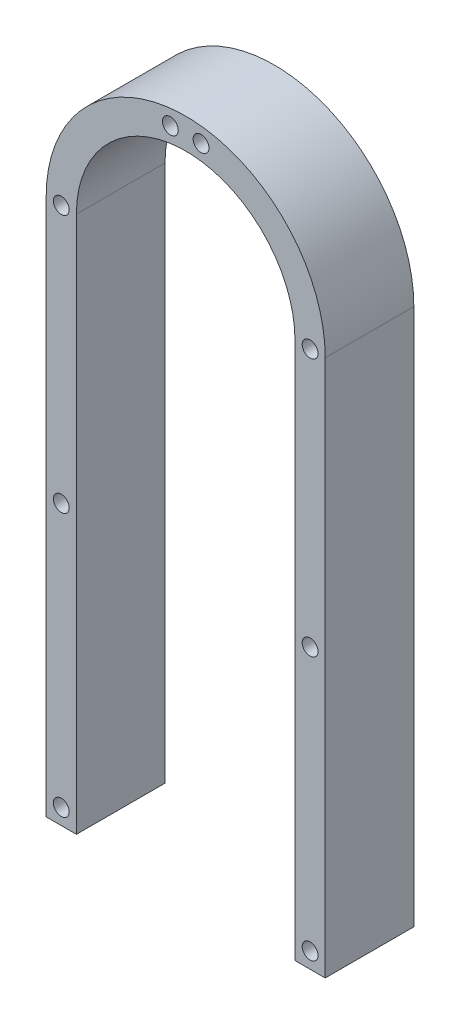
ISO-10303-21;
HEADER;
FILE_DESCRIPTION(('STEP AP214'),'2;1');
FILE_NAME('part.step','',(''),(''),'','','');
FILE_SCHEMA(('AUTOMOTIVE_DESIGN { 1 0 10303 214 1 1 1 1 }'));
ENDSEC;
DATA;
#1=APPLICATION_CONTEXT('core data for automotive mechanical design processes');
#2=APPLICATION_PROTOCOL_DEFINITION('international standard','automotive_design',2000,#1);
#3=PRODUCT_CONTEXT('',#1,'mechanical');
#4=PRODUCT('Part','Part','',(#3));
#5=PRODUCT_RELATED_PRODUCT_CATEGORY('part','',(#4));
#6=PRODUCT_DEFINITION_FORMATION('','',#4);
#7=PRODUCT_DEFINITION_CONTEXT('part definition',#1,'design');
#8=PRODUCT_DEFINITION('design','',#6,#7);
#9=PRODUCT_DEFINITION_SHAPE('','',#8);
#10=(LENGTH_UNIT() NAMED_UNIT(*) SI_UNIT(.MILLI.,.METRE.));
#11=(NAMED_UNIT(*) PLANE_ANGLE_UNIT() SI_UNIT($,.RADIAN.));
#12=(NAMED_UNIT(*) SI_UNIT($,.STERADIAN.) SOLID_ANGLE_UNIT());
#13=UNCERTAINTY_MEASURE_WITH_UNIT(LENGTH_MEASURE(1.E-05),#10,'distance_accuracy_value','');
#14=(GEOMETRIC_REPRESENTATION_CONTEXT(3) GLOBAL_UNCERTAINTY_ASSIGNED_CONTEXT((#13)) GLOBAL_UNIT_ASSIGNED_CONTEXT((#10,
#11,#12)) REPRESENTATION_CONTEXT('',''));
#15=CARTESIAN_POINT('',(0.,0.,0.));
#16=DIRECTION('',(0.,0.,1.));
#17=DIRECTION('',(1.,0.,0.));
#18=AXIS2_PLACEMENT_3D('',#15,#16,#17);
#19=CARTESIAN_POINT('',(-149.085368150531,-18.7891941834329,19.05));
#20=DIRECTION('',(0.,0.,1.));
#21=DIRECTION('',(1.,0.,0.));
#22=AXIS2_PLACEMENT_3D('',#19,#20,#21);
#23=PLANE('',#22);
#24=DIRECTION('',(-1.,0.,0.));
#25=VECTOR('',#24,1.);
#26=CARTESIAN_POINT('',(-149.085368150531,96.6995702810626,19.05));
#27=LINE('',#26,#25);
#28=CARTESIAN_POINT('',(-119.085368150531,96.6995702810626,19.05));
#29=VERTEX_POINT('',#28);
#30=CARTESIAN_POINT('',(-125.585368150531,96.6995702810626,19.05));
#31=VERTEX_POINT('',#30);
#32=EDGE_CURVE('E49',#29,#31,#27,.T.);
#33=ORIENTED_EDGE('',*,*,#32,.F.);
#34=DIRECTION('',(0.,1.,0.));
#35=VECTOR('',#34,1.);
#36=CARTESIAN_POINT('',(-119.085368150531,-18.7891941834329,19.05));
#37=LINE('',#36,#35);
#38=CARTESIAN_POINT('',(-119.085368150531,212.188334745558,19.05));
#39=VERTEX_POINT('',#38);
#40=EDGE_CURVE('E109',#29,#39,#37,.T.);
#41=ORIENTED_EDGE('',*,*,#40,.T.);
#42=CARTESIAN_POINT('',(-149.085368150531,212.188334745558,19.05));
#43=DIRECTION('',(0.,0.,1.));
#44=DIRECTION('',(1.,0.,0.));
#45=AXIS2_PLACEMENT_3D('',#42,#43,#44);
#46=CIRCLE('',#45,30.);
#47=CARTESIAN_POINT('',(-179.085368150531,212.188334745558,19.05));
#48=VERTEX_POINT('',#47);
#49=EDGE_CURVE('E117',#39,#48,#46,.T.);
#50=ORIENTED_EDGE('',*,*,#49,.T.);
#51=DIRECTION('',(0.,-1.,0.));
#52=VECTOR('',#51,1.);
#53=CARTESIAN_POINT('',(-179.085368150531,-18.7891941834329,19.05));
#54=LINE('',#53,#52);
#55=CARTESIAN_POINT('',(-179.085368150531,96.6995702810626,19.05));
#56=VERTEX_POINT('',#55);
#57=EDGE_CURVE('E120',#48,#56,#54,.T.);
#58=ORIENTED_EDGE('',*,*,#57,.T.);
#59=CARTESIAN_POINT('',(-172.585368150531,96.6995702810626,19.05));
#60=VERTEX_POINT('',#59);
#61=EDGE_CURVE('E113',#60,#56,#27,.T.);
#62=ORIENTED_EDGE('',*,*,#61,.F.);
#63=DIRECTION('',(0.,-1.,0.));
#64=VECTOR('',#63,1.);
#65=CARTESIAN_POINT('',(-172.585368150531,-18.7891941834329,19.05));
#66=LINE('',#65,#64);
#67=CARTESIAN_POINT('',(-172.585368150531,212.188334745558,19.05));
#68=VERTEX_POINT('',#67);
#69=EDGE_CURVE('E151',#68,#60,#66,.T.);
#70=ORIENTED_EDGE('',*,*,#69,.F.);
#71=CARTESIAN_POINT('',(-149.085368150531,212.188334745558,19.05));
#72=DIRECTION('',(0.,0.,1.));
#73=DIRECTION('',(1.,0.,0.));
#74=AXIS2_PLACEMENT_3D('',#71,#72,#73);
#75=CIRCLE('',#74,23.5);
#76=CARTESIAN_POINT('',(-125.585368150531,212.188334745558,19.05));
#77=VERTEX_POINT('',#76);
#78=EDGE_CURVE('E157',#77,#68,#75,.T.);
#79=ORIENTED_EDGE('',*,*,#78,.F.);
#80=DIRECTION('',(0.,1.,0.));
#81=VECTOR('',#80,1.);
#82=CARTESIAN_POINT('',(-125.585368150531,-18.7891941834329,19.05));
#83=LINE('',#82,#81);
#84=EDGE_CURVE('E112',#31,#77,#83,.T.);
#85=ORIENTED_EDGE('',*,*,#84,.F.);
#86=EDGE_LOOP('',(#33,#41,#50,#58,#62,#70,#79,#85));
#87=FACE_BOUND('',#86,.T.);
#88=CARTESIAN_POINT('',(-122.335368150531,100.099570281063,19.05));
#89=DIRECTION('',(0.,0.,1.));
#90=DIRECTION('',(1.,0.,0.));
#91=AXIS2_PLACEMENT_3D('',#88,#89,#90);
#92=CIRCLE('',#91,1.7);
#93=CARTESIAN_POINT('',(-120.635368150531,100.099570281063,19.05));
#94=VERTEX_POINT('',#93);
#95=EDGE_CURVE('E103',#94,#94,#92,.T.);
#96=ORIENTED_EDGE('',*,*,#95,.F.);
#97=EDGE_LOOP('',(#96));
#98=FACE_BOUND('',#97,.T.);
#99=CARTESIAN_POINT('',(-152.385368150531,238.734002942083,19.05));
#100=DIRECTION('',(0.,0.,1.));
#101=DIRECTION('',(1.,0.,0.));
#102=AXIS2_PLACEMENT_3D('',#99,#100,#101);
#103=CIRCLE('',#102,1.70000000000001);
#104=CARTESIAN_POINT('',(-150.685368150531,238.734002942083,19.05));
#105=VERTEX_POINT('',#104);
#106=EDGE_CURVE('E209',#105,#105,#103,.T.);
#107=ORIENTED_EDGE('',*,*,#106,.F.);
#108=EDGE_LOOP('',(#107));
#109=FACE_BOUND('',#108,.T.);
#110=CARTESIAN_POINT('',(-122.335368150531,156.699570281063,19.05));
#111=DIRECTION('',(0.,0.,1.));
#112=DIRECTION('',(1.,0.,0.));
#113=AXIS2_PLACEMENT_3D('',#110,#111,#112);
#114=CIRCLE('',#113,1.7);
#115=CARTESIAN_POINT('',(-120.635368150531,156.699570281063,19.05));
#116=VERTEX_POINT('',#115);
#117=EDGE_CURVE('E203',#116,#116,#114,.T.);
#118=ORIENTED_EDGE('',*,*,#117,.F.);
#119=EDGE_LOOP('',(#118));
#120=FACE_BOUND('',#119,.T.);
#121=CARTESIAN_POINT('',(-175.835368150531,156.699570281063,19.05));
#122=DIRECTION('',(0.,0.,1.));
#123=DIRECTION('',(1.,0.,0.));
#124=AXIS2_PLACEMENT_3D('',#121,#122,#123);
#125=CIRCLE('',#124,1.70000000000001);
#126=CARTESIAN_POINT('',(-174.135368150531,156.699570281063,19.05));
#127=VERTEX_POINT('',#126);
#128=EDGE_CURVE('E197',#127,#127,#125,.T.);
#129=ORIENTED_EDGE('',*,*,#128,.F.);
#130=EDGE_LOOP('',(#129));
#131=FACE_BOUND('',#130,.T.);
#132=CARTESIAN_POINT('',(-175.835368150531,100.099570281063,19.05));
#133=DIRECTION('',(0.,0.,1.));
#134=DIRECTION('',(1.,0.,0.));
#135=AXIS2_PLACEMENT_3D('',#132,#133,#134);
#136=CIRCLE('',#135,1.70000000000001);
#137=CARTESIAN_POINT('',(-174.135368150531,100.099570281063,19.05));
#138=VERTEX_POINT('',#137);
#139=EDGE_CURVE('E191',#138,#138,#136,.T.);
#140=ORIENTED_EDGE('',*,*,#139,.F.);
#141=EDGE_LOOP('',(#140));
#142=FACE_BOUND('',#141,.T.);
#143=CARTESIAN_POINT('',(-175.835368150529,212.188334745556,19.05));
#144=DIRECTION('',(0.,0.,1.));
#145=DIRECTION('',(1.,0.,0.));
#146=AXIS2_PLACEMENT_3D('',#143,#144,#145);
#147=CIRCLE('',#146,1.70000000000001);
#148=CARTESIAN_POINT('',(-174.135368150529,212.188334745556,19.05));
#149=VERTEX_POINT('',#148);
#150=EDGE_CURVE('E185',#149,#149,#147,.T.);
#151=ORIENTED_EDGE('',*,*,#150,.F.);
#152=EDGE_LOOP('',(#151));
#153=FACE_BOUND('',#152,.T.);
#154=CARTESIAN_POINT('',(-122.335368150529,212.18833474556,19.05));
#155=DIRECTION('',(0.,0.,1.));
#156=DIRECTION('',(1.,0.,0.));
#157=AXIS2_PLACEMENT_3D('',#154,#155,#156);
#158=CIRCLE('',#157,1.7);
#159=CARTESIAN_POINT('',(-120.635368150529,212.18833474556,19.05));
#160=VERTEX_POINT('',#159);
#161=EDGE_CURVE('E179',#160,#160,#158,.T.);
#162=ORIENTED_EDGE('',*,*,#161,.F.);
#163=EDGE_LOOP('',(#162));
#164=FACE_BOUND('',#163,.T.);
#165=CARTESIAN_POINT('',(-145.785368150531,238.734002942083,19.05));
#166=DIRECTION('',(0.,0.,1.));
#167=DIRECTION('',(1.,0.,0.));
#168=AXIS2_PLACEMENT_3D('',#165,#166,#167);
#169=CIRCLE('',#168,1.70000000000001);
#170=CARTESIAN_POINT('',(-144.085368150531,238.734002942083,19.05));
#171=VERTEX_POINT('',#170);
#172=EDGE_CURVE('E173',#171,#171,#169,.T.);
#173=ORIENTED_EDGE('',*,*,#172,.F.);
#174=EDGE_LOOP('',(#173));
#175=FACE_BOUND('',#174,.T.);
#176=ADVANCED_FACE('F34',(#87,#98,#109,#120,#131,#142,#153,#164,#175),#23,.T.);
#177=CARTESIAN_POINT('',(-149.085368150531,-18.7891941834329,0.));
#178=DIRECTION('',(0.,0.,1.));
#179=DIRECTION('',(1.,0.,0.));
#180=AXIS2_PLACEMENT_3D('',#177,#178,#179);
#181=PLANE('',#180);
#182=CARTESIAN_POINT('',(-122.335368150531,100.099570281063,0.));
#183=DIRECTION('',(0.,0.,1.));
#184=DIRECTION('',(1.,0.,0.));
#185=AXIS2_PLACEMENT_3D('',#182,#183,#184);
#186=CIRCLE('',#185,1.7);
#187=CARTESIAN_POINT('',(-120.635368150531,100.099570281063,0.));
#188=VERTEX_POINT('',#187);
#189=EDGE_CURVE('E212',#188,#188,#186,.T.);
#190=ORIENTED_EDGE('',*,*,#189,.T.);
#191=EDGE_LOOP('',(#190));
#192=FACE_BOUND('',#191,.T.);
#193=CARTESIAN_POINT('',(-152.385368150531,238.734002942083,0.));
#194=DIRECTION('',(0.,0.,1.));
#195=DIRECTION('',(1.,0.,0.));
#196=AXIS2_PLACEMENT_3D('',#193,#194,#195);
#197=CIRCLE('',#196,1.70000000000001);
#198=CARTESIAN_POINT('',(-150.685368150531,238.734002942083,0.));
#199=VERTEX_POINT('',#198);
#200=EDGE_CURVE('E206',#199,#199,#197,.T.);
#201=ORIENTED_EDGE('',*,*,#200,.T.);
#202=EDGE_LOOP('',(#201));
#203=FACE_BOUND('',#202,.T.);
#204=CARTESIAN_POINT('',(-122.335368150531,156.699570281063,0.));
#205=DIRECTION('',(0.,0.,1.));
#206=DIRECTION('',(1.,0.,0.));
#207=AXIS2_PLACEMENT_3D('',#204,#205,#206);
#208=CIRCLE('',#207,1.7);
#209=CARTESIAN_POINT('',(-120.635368150531,156.699570281063,0.));
#210=VERTEX_POINT('',#209);
#211=EDGE_CURVE('E200',#210,#210,#208,.T.);
#212=ORIENTED_EDGE('',*,*,#211,.T.);
#213=EDGE_LOOP('',(#212));
#214=FACE_BOUND('',#213,.T.);
#215=CARTESIAN_POINT('',(-175.835368150531,156.699570281063,0.));
#216=DIRECTION('',(0.,0.,1.));
#217=DIRECTION('',(1.,0.,0.));
#218=AXIS2_PLACEMENT_3D('',#215,#216,#217);
#219=CIRCLE('',#218,1.70000000000001);
#220=CARTESIAN_POINT('',(-174.135368150531,156.699570281063,0.));
#221=VERTEX_POINT('',#220);
#222=EDGE_CURVE('E194',#221,#221,#219,.T.);
#223=ORIENTED_EDGE('',*,*,#222,.T.);
#224=EDGE_LOOP('',(#223));
#225=FACE_BOUND('',#224,.T.);
#226=CARTESIAN_POINT('',(-175.835368150531,100.099570281063,0.));
#227=DIRECTION('',(0.,0.,1.));
#228=DIRECTION('',(1.,0.,0.));
#229=AXIS2_PLACEMENT_3D('',#226,#227,#228);
#230=CIRCLE('',#229,1.70000000000001);
#231=CARTESIAN_POINT('',(-174.135368150531,100.099570281063,0.));
#232=VERTEX_POINT('',#231);
#233=EDGE_CURVE('E188',#232,#232,#230,.T.);
#234=ORIENTED_EDGE('',*,*,#233,.T.);
#235=EDGE_LOOP('',(#234));
#236=FACE_BOUND('',#235,.T.);
#237=CARTESIAN_POINT('',(-175.835368150529,212.188334745556,0.));
#238=DIRECTION('',(0.,0.,1.));
#239=DIRECTION('',(1.,0.,0.));
#240=AXIS2_PLACEMENT_3D('',#237,#238,#239);
#241=CIRCLE('',#240,1.70000000000001);
#242=CARTESIAN_POINT('',(-174.135368150529,212.188334745556,0.));
#243=VERTEX_POINT('',#242);
#244=EDGE_CURVE('E182',#243,#243,#241,.T.);
#245=ORIENTED_EDGE('',*,*,#244,.T.);
#246=EDGE_LOOP('',(#245));
#247=FACE_BOUND('',#246,.T.);
#248=CARTESIAN_POINT('',(-122.335368150529,212.18833474556,0.));
#249=DIRECTION('',(0.,0.,1.));
#250=DIRECTION('',(1.,0.,0.));
#251=AXIS2_PLACEMENT_3D('',#248,#249,#250);
#252=CIRCLE('',#251,1.7);
#253=CARTESIAN_POINT('',(-120.635368150529,212.18833474556,0.));
#254=VERTEX_POINT('',#253);
#255=EDGE_CURVE('E176',#254,#254,#252,.T.);
#256=ORIENTED_EDGE('',*,*,#255,.T.);
#257=EDGE_LOOP('',(#256));
#258=FACE_BOUND('',#257,.T.);
#259=CARTESIAN_POINT('',(-145.785368150531,238.734002942083,0.));
#260=DIRECTION('',(0.,0.,1.));
#261=DIRECTION('',(1.,0.,0.));
#262=AXIS2_PLACEMENT_3D('',#259,#260,#261);
#263=CIRCLE('',#262,1.70000000000001);
#264=CARTESIAN_POINT('',(-144.085368150531,238.734002942083,0.));
#265=VERTEX_POINT('',#264);
#266=EDGE_CURVE('E165',#265,#265,#263,.T.);
#267=ORIENTED_EDGE('',*,*,#266,.T.);
#268=EDGE_LOOP('',(#267));
#269=FACE_BOUND('',#268,.T.);
#270=DIRECTION('',(0.,1.,0.));
#271=VECTOR('',#270,1.);
#272=CARTESIAN_POINT('',(-119.085368150531,-18.7891941834329,0.));
#273=LINE('',#272,#271);
#274=CARTESIAN_POINT('',(-119.085368150531,96.6995702810626,0.));
#275=VERTEX_POINT('',#274);
#276=CARTESIAN_POINT('',(-119.085368150531,212.188334745558,0.));
#277=VERTEX_POINT('',#276);
#278=EDGE_CURVE('E132',#275,#277,#273,.T.);
#279=ORIENTED_EDGE('',*,*,#278,.F.);
#280=DIRECTION('',(-1.,0.,0.));
#281=VECTOR('',#280,1.);
#282=CARTESIAN_POINT('',(-149.085368150531,96.6995702810626,0.));
#283=LINE('',#282,#281);
#284=CARTESIAN_POINT('',(-125.585368150531,96.6995702810626,0.));
#285=VERTEX_POINT('',#284);
#286=EDGE_CURVE('E99',#275,#285,#283,.T.);
#287=ORIENTED_EDGE('',*,*,#286,.T.);
#288=DIRECTION('',(0.,1.,0.));
#289=VECTOR('',#288,1.);
#290=CARTESIAN_POINT('',(-125.585368150531,-18.7891941834329,0.));
#291=LINE('',#290,#289);
#292=CARTESIAN_POINT('',(-125.585368150531,212.188334745558,0.));
#293=VERTEX_POINT('',#292);
#294=EDGE_CURVE('E162',#285,#293,#291,.T.);
#295=ORIENTED_EDGE('',*,*,#294,.T.);
#296=CARTESIAN_POINT('',(-149.085368150531,212.188334745558,0.));
#297=DIRECTION('',(0.,0.,1.));
#298=DIRECTION('',(1.,0.,0.));
#299=AXIS2_PLACEMENT_3D('',#296,#297,#298);
#300=CIRCLE('',#299,23.5);
#301=CARTESIAN_POINT('',(-172.585368150531,212.188334745558,0.));
#302=VERTEX_POINT('',#301);
#303=EDGE_CURVE('E164',#293,#302,#300,.T.);
#304=ORIENTED_EDGE('',*,*,#303,.T.);
#305=DIRECTION('',(0.,-1.,0.));
#306=VECTOR('',#305,1.);
#307=CARTESIAN_POINT('',(-172.585368150531,-18.7891941834329,0.));
#308=LINE('',#307,#306);
#309=CARTESIAN_POINT('',(-172.585368150531,96.6995702810626,0.));
#310=VERTEX_POINT('',#309);
#311=EDGE_CURVE('E168',#302,#310,#308,.T.);
#312=ORIENTED_EDGE('',*,*,#311,.T.);
#313=CARTESIAN_POINT('',(-179.085368150531,96.6995702810626,0.));
#314=VERTEX_POINT('',#313);
#315=EDGE_CURVE('E56',#310,#314,#283,.T.);
#316=ORIENTED_EDGE('',*,*,#315,.T.);
#317=DIRECTION('',(0.,-1.,0.));
#318=VECTOR('',#317,1.);
#319=CARTESIAN_POINT('',(-179.085368150531,-18.7891941834329,0.));
#320=LINE('',#319,#318);
#321=CARTESIAN_POINT('',(-179.085368150531,212.188334745558,0.));
#322=VERTEX_POINT('',#321);
#323=EDGE_CURVE('E118',#322,#314,#320,.T.);
#324=ORIENTED_EDGE('',*,*,#323,.F.);
#325=CARTESIAN_POINT('',(-149.085368150531,212.188334745558,0.));
#326=DIRECTION('',(0.,0.,1.));
#327=DIRECTION('',(1.,0.,0.));
#328=AXIS2_PLACEMENT_3D('',#325,#326,#327);
#329=CIRCLE('',#328,30.);
#330=EDGE_CURVE('E123',#277,#322,#329,.T.);
#331=ORIENTED_EDGE('',*,*,#330,.F.);
#332=EDGE_LOOP('',(#279,#287,#295,#304,#312,#316,#324,#331));
#333=FACE_BOUND('',#332,.T.);
#334=ADVANCED_FACE('F142',(#192,#203,#214,#225,#236,#247,#258,#269,#333),#181,.F.);
#335=CARTESIAN_POINT('',(-119.085368150531,-18.7891941834329,19.05));
#336=DIRECTION('',(-1.,0.,0.));
#337=DIRECTION('',(0.,0.,1.));
#338=AXIS2_PLACEMENT_3D('',#335,#336,#337);
#339=PLANE('',#338);
#340=ORIENTED_EDGE('',*,*,#40,.F.);
#341=DIRECTION('',(0.,0.,-1.));
#342=VECTOR('',#341,1.);
#343=CARTESIAN_POINT('',(-119.085368150531,96.6995702810626,19.05));
#344=LINE('',#343,#342);
#345=EDGE_CURVE('E96',#29,#275,#344,.T.);
#346=ORIENTED_EDGE('',*,*,#345,.T.);
#347=ORIENTED_EDGE('',*,*,#278,.T.);
#348=DIRECTION('',(0.,0.,-1.));
#349=VECTOR('',#348,1.);
#350=CARTESIAN_POINT('',(-119.085368150531,212.188334745558,19.05));
#351=LINE('',#350,#349);
#352=EDGE_CURVE('E42',#39,#277,#351,.T.);
#353=ORIENTED_EDGE('',*,*,#352,.F.);
#354=EDGE_LOOP('',(#340,#346,#347,#353));
#355=FACE_BOUND('',#354,.T.);
#356=ADVANCED_FACE('F36',(#355),#339,.F.);
#357=CARTESIAN_POINT('',(-149.085368150531,212.188334745558,19.05));
#358=DIRECTION('',(0.,0.,-1.));
#359=DIRECTION('',(-1.,0.,0.));
#360=AXIS2_PLACEMENT_3D('',#357,#358,#359);
#361=CYLINDRICAL_SURFACE('',#360,30.);
#362=ORIENTED_EDGE('',*,*,#330,.T.);
#363=DIRECTION('',(0.,0.,-1.));
#364=VECTOR('',#363,1.);
#365=CARTESIAN_POINT('',(-179.085368150531,212.188334745558,19.05));
#366=LINE('',#365,#364);
#367=EDGE_CURVE('E131',#48,#322,#366,.T.);
#368=ORIENTED_EDGE('',*,*,#367,.F.);
#369=ORIENTED_EDGE('',*,*,#49,.F.);
#370=ORIENTED_EDGE('',*,*,#352,.T.);
#371=EDGE_LOOP('',(#362,#368,#369,#370));
#372=FACE_BOUND('',#371,.T.);
#373=ADVANCED_FACE('F138',(#372),#361,.T.);
#374=CARTESIAN_POINT('',(-179.085368150531,-18.7891941834329,19.05));
#375=DIRECTION('',(1.,0.,0.));
#376=DIRECTION('',(0.,0.,-1.));
#377=AXIS2_PLACEMENT_3D('',#374,#375,#376);
#378=PLANE('',#377);
#379=ORIENTED_EDGE('',*,*,#323,.T.);
#380=DIRECTION('',(0.,0.,1.));
#381=VECTOR('',#380,1.);
#382=CARTESIAN_POINT('',(-179.085368150531,96.6995702810626,19.05));
#383=LINE('',#382,#381);
#384=EDGE_CURVE('E104',#314,#56,#383,.T.);
#385=ORIENTED_EDGE('',*,*,#384,.T.);
#386=ORIENTED_EDGE('',*,*,#57,.F.);
#387=ORIENTED_EDGE('',*,*,#367,.T.);
#388=EDGE_LOOP('',(#379,#385,#386,#387));
#389=FACE_BOUND('',#388,.T.);
#390=ADVANCED_FACE('F146',(#389),#378,.F.);
#391=CARTESIAN_POINT('',(-125.585368150531,-18.7891941834329,19.05));
#392=DIRECTION('',(-1.,0.,0.));
#393=DIRECTION('',(0.,-1.,0.));
#394=AXIS2_PLACEMENT_3D('',#391,#392,#393);
#395=PLANE('',#394);
#396=DIRECTION('',(0.,0.,-1.));
#397=VECTOR('',#396,1.);
#398=CARTESIAN_POINT('',(-125.585368150531,96.6995702810626,19.05));
#399=LINE('',#398,#397);
#400=EDGE_CURVE('E220',#31,#285,#399,.T.);
#401=ORIENTED_EDGE('',*,*,#400,.F.);
#402=ORIENTED_EDGE('',*,*,#84,.T.);
#403=DIRECTION('',(0.,0.,-1.));
#404=VECTOR('',#403,1.);
#405=CARTESIAN_POINT('',(-125.585368150531,212.188334745558,19.05));
#406=LINE('',#405,#404);
#407=EDGE_CURVE('E126',#77,#293,#406,.T.);
#408=ORIENTED_EDGE('',*,*,#407,.T.);
#409=ORIENTED_EDGE('',*,*,#294,.F.);
#410=EDGE_LOOP('',(#401,#402,#408,#409));
#411=FACE_BOUND('',#410,.T.);
#412=ADVANCED_FACE('F223',(#411),#395,.T.);
#413=CARTESIAN_POINT('',(-149.085368150531,212.188334745558,19.05));
#414=DIRECTION('',(0.,0.,-1.));
#415=DIRECTION('',(-1.,0.,0.));
#416=AXIS2_PLACEMENT_3D('',#413,#414,#415);
#417=CYLINDRICAL_SURFACE('',#416,23.5);
#418=ORIENTED_EDGE('',*,*,#303,.F.);
#419=ORIENTED_EDGE('',*,*,#407,.F.);
#420=ORIENTED_EDGE('',*,*,#78,.T.);
#421=DIRECTION('',(0.,0.,-1.));
#422=VECTOR('',#421,1.);
#423=CARTESIAN_POINT('',(-172.585368150531,212.188334745558,19.05));
#424=LINE('',#423,#422);
#425=EDGE_CURVE('E155',#68,#302,#424,.T.);
#426=ORIENTED_EDGE('',*,*,#425,.T.);
#427=EDGE_LOOP('',(#418,#419,#420,#426));
#428=FACE_BOUND('',#427,.T.);
#429=ADVANCED_FACE('F226',(#428),#417,.F.);
#430=CARTESIAN_POINT('',(-172.585368150531,-18.7891941834329,19.05));
#431=DIRECTION('',(1.,0.,0.));
#432=DIRECTION('',(0.,1.,0.));
#433=AXIS2_PLACEMENT_3D('',#430,#431,#432);
#434=PLANE('',#433);
#435=DIRECTION('',(0.,0.,1.));
#436=VECTOR('',#435,1.);
#437=CARTESIAN_POINT('',(-172.585368150531,96.6995702810626,19.05));
#438=LINE('',#437,#436);
#439=EDGE_CURVE('E11',#310,#60,#438,.T.);
#440=ORIENTED_EDGE('',*,*,#439,.F.);
#441=ORIENTED_EDGE('',*,*,#311,.F.);
#442=ORIENTED_EDGE('',*,*,#425,.F.);
#443=ORIENTED_EDGE('',*,*,#69,.T.);
#444=EDGE_LOOP('',(#440,#441,#442,#443));
#445=FACE_BOUND('',#444,.T.);
#446=ADVANCED_FACE('F153',(#445),#434,.T.);
#447=CARTESIAN_POINT('',(-145.785368150531,238.734002942083,0.));
#448=DIRECTION('',(0.,0.,1.));
#449=DIRECTION('',(1.,0.,0.));
#450=AXIS2_PLACEMENT_3D('',#447,#448,#449);
#451=CYLINDRICAL_SURFACE('',#450,1.70000000000001);
#452=ORIENTED_EDGE('',*,*,#266,.F.);
#453=EDGE_LOOP('',(#452));
#454=FACE_BOUND('',#453,.T.);
#455=ORIENTED_EDGE('',*,*,#172,.T.);
#456=EDGE_LOOP('',(#455));
#457=FACE_BOUND('',#456,.T.);
#458=ADVANCED_FACE('F233',(#454,#457),#451,.F.);
#459=CARTESIAN_POINT('',(-122.335368150529,212.18833474556,0.));
#460=DIRECTION('',(0.,0.,1.));
#461=DIRECTION('',(1.,0.,0.));
#462=AXIS2_PLACEMENT_3D('',#459,#460,#461);
#463=CYLINDRICAL_SURFACE('',#462,1.7);
#464=ORIENTED_EDGE('',*,*,#255,.F.);
#465=EDGE_LOOP('',(#464));
#466=FACE_BOUND('',#465,.T.);
#467=ORIENTED_EDGE('',*,*,#161,.T.);
#468=EDGE_LOOP('',(#467));
#469=FACE_BOUND('',#468,.T.);
#470=ADVANCED_FACE('F326',(#466,#469),#463,.F.);
#471=CARTESIAN_POINT('',(-175.835368150529,212.188334745556,0.));
#472=DIRECTION('',(0.,0.,1.));
#473=DIRECTION('',(1.,0.,0.));
#474=AXIS2_PLACEMENT_3D('',#471,#472,#473);
#475=CYLINDRICAL_SURFACE('',#474,1.70000000000001);
#476=ORIENTED_EDGE('',*,*,#244,.F.);
#477=EDGE_LOOP('',(#476));
#478=FACE_BOUND('',#477,.T.);
#479=ORIENTED_EDGE('',*,*,#150,.T.);
#480=EDGE_LOOP('',(#479));
#481=FACE_BOUND('',#480,.T.);
#482=ADVANCED_FACE('F316',(#478,#481),#475,.F.);
#483=CARTESIAN_POINT('',(-175.835368150531,100.099570281063,0.));
#484=DIRECTION('',(0.,0.,1.));
#485=DIRECTION('',(1.,0.,0.));
#486=AXIS2_PLACEMENT_3D('',#483,#484,#485);
#487=CYLINDRICAL_SURFACE('',#486,1.70000000000001);
#488=ORIENTED_EDGE('',*,*,#233,.F.);
#489=EDGE_LOOP('',(#488));
#490=FACE_BOUND('',#489,.T.);
#491=ORIENTED_EDGE('',*,*,#139,.T.);
#492=EDGE_LOOP('',(#491));
#493=FACE_BOUND('',#492,.T.);
#494=ADVANCED_FACE('F306',(#490,#493),#487,.F.);
#495=CARTESIAN_POINT('',(-175.835368150531,156.699570281063,0.));
#496=DIRECTION('',(0.,0.,1.));
#497=DIRECTION('',(1.,0.,0.));
#498=AXIS2_PLACEMENT_3D('',#495,#496,#497);
#499=CYLINDRICAL_SURFACE('',#498,1.70000000000001);
#500=ORIENTED_EDGE('',*,*,#222,.F.);
#501=EDGE_LOOP('',(#500));
#502=FACE_BOUND('',#501,.T.);
#503=ORIENTED_EDGE('',*,*,#128,.T.);
#504=EDGE_LOOP('',(#503));
#505=FACE_BOUND('',#504,.T.);
#506=ADVANCED_FACE('F296',(#502,#505),#499,.F.);
#507=CARTESIAN_POINT('',(-122.335368150531,156.699570281063,0.));
#508=DIRECTION('',(0.,0.,1.));
#509=DIRECTION('',(1.,0.,0.));
#510=AXIS2_PLACEMENT_3D('',#507,#508,#509);
#511=CYLINDRICAL_SURFACE('',#510,1.7);
#512=ORIENTED_EDGE('',*,*,#211,.F.);
#513=EDGE_LOOP('',(#512));
#514=FACE_BOUND('',#513,.T.);
#515=ORIENTED_EDGE('',*,*,#117,.T.);
#516=EDGE_LOOP('',(#515));
#517=FACE_BOUND('',#516,.T.);
#518=ADVANCED_FACE('F286',(#514,#517),#511,.F.);
#519=CARTESIAN_POINT('',(-152.385368150531,238.734002942083,0.));
#520=DIRECTION('',(0.,0.,1.));
#521=DIRECTION('',(1.,0.,0.));
#522=AXIS2_PLACEMENT_3D('',#519,#520,#521);
#523=CYLINDRICAL_SURFACE('',#522,1.70000000000001);
#524=ORIENTED_EDGE('',*,*,#200,.F.);
#525=EDGE_LOOP('',(#524));
#526=FACE_BOUND('',#525,.T.);
#527=ORIENTED_EDGE('',*,*,#106,.T.);
#528=EDGE_LOOP('',(#527));
#529=FACE_BOUND('',#528,.T.);
#530=ADVANCED_FACE('F274',(#526,#529),#523,.F.);
#531=CARTESIAN_POINT('',(-122.335368150531,100.099570281063,0.));
#532=DIRECTION('',(0.,0.,1.));
#533=DIRECTION('',(1.,0.,0.));
#534=AXIS2_PLACEMENT_3D('',#531,#532,#533);
#535=CYLINDRICAL_SURFACE('',#534,1.7);
#536=ORIENTED_EDGE('',*,*,#189,.F.);
#537=EDGE_LOOP('',(#536));
#538=FACE_BOUND('',#537,.T.);
#539=ORIENTED_EDGE('',*,*,#95,.T.);
#540=EDGE_LOOP('',(#539));
#541=FACE_BOUND('',#540,.T.);
#542=ADVANCED_FACE('F268',(#538,#541),#535,.F.);
#543=CARTESIAN_POINT('',(-149.085368150531,96.6995702810626,0.));
#544=DIRECTION('',(0.,1.,0.));
#545=DIRECTION('',(0.,0.,1.));
#546=AXIS2_PLACEMENT_3D('',#543,#544,#545);
#547=PLANE('',#546);
#548=ORIENTED_EDGE('',*,*,#315,.F.);
#549=ORIENTED_EDGE('',*,*,#439,.T.);
#550=ORIENTED_EDGE('',*,*,#61,.T.);
#551=ORIENTED_EDGE('',*,*,#384,.F.);
#552=EDGE_LOOP('',(#548,#549,#550,#551));
#553=FACE_BOUND('',#552,.T.);
#554=ADVANCED_FACE('F273',(#553),#547,.F.);
#555=ORIENTED_EDGE('',*,*,#32,.T.);
#556=ORIENTED_EDGE('',*,*,#400,.T.);
#557=ORIENTED_EDGE('',*,*,#286,.F.);
#558=ORIENTED_EDGE('',*,*,#345,.F.);
#559=EDGE_LOOP('',(#555,#556,#557,#558));
#560=FACE_BOUND('',#559,.T.);
#561=ADVANCED_FACE('F97',(#560),#547,.F.);
#562=CLOSED_SHELL('',(#176,#334,#356,#373,#390,#412,#429,#446,#458,#470,#482,#494,#506,#518,
#530,#542,#554,#561));
#563=MANIFOLD_SOLID_BREP('B2',#562);
#564=ADVANCED_BREP_SHAPE_REPRESENTATION('',(#18,#563),#14);
#565=SHAPE_DEFINITION_REPRESENTATION(#9,#564);
ENDSEC;
END-ISO-10303-21;
